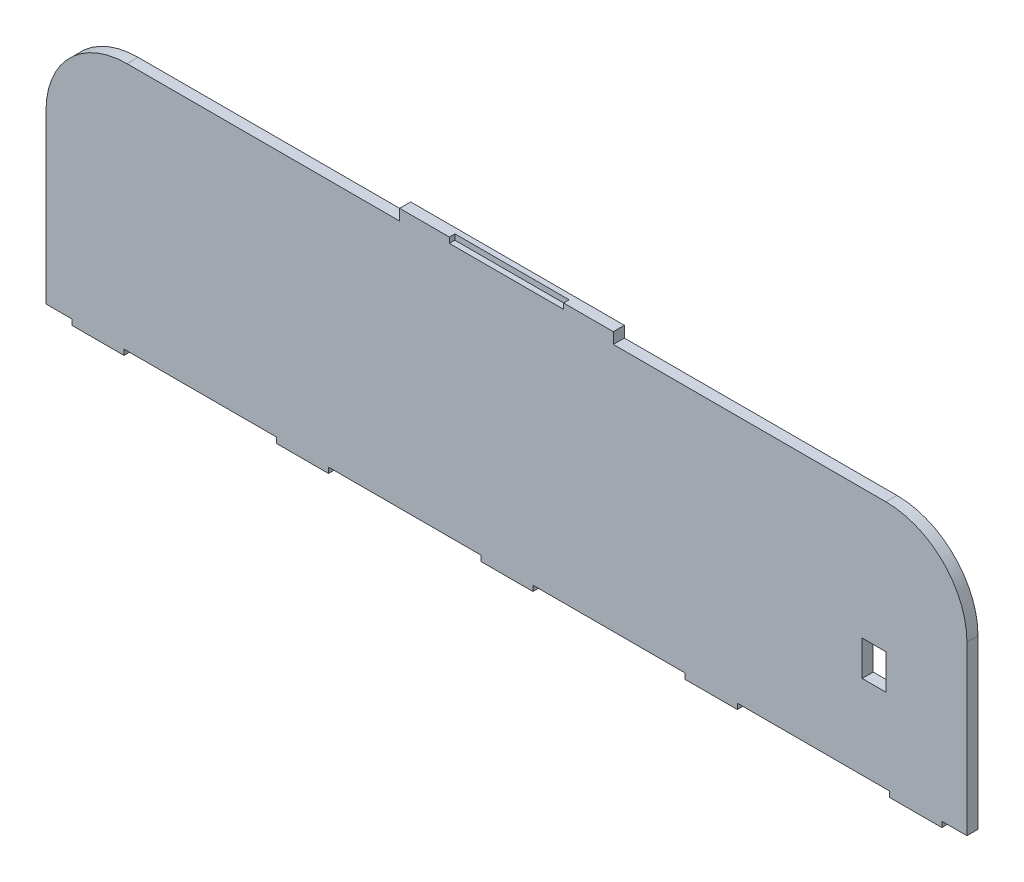
ISO-10303-21;
HEADER;
FILE_DESCRIPTION(('STEP AP214'),'2;1');
FILE_NAME('part.step','',(''),(''),'','','');
FILE_SCHEMA(('AUTOMOTIVE_DESIGN { 1 0 10303 214 1 1 1 1 }'));
ENDSEC;
DATA;
#1=APPLICATION_CONTEXT('core data for automotive mechanical design processes');
#2=APPLICATION_PROTOCOL_DEFINITION('international standard','automotive_design',2000,#1);
#3=PRODUCT_CONTEXT('',#1,'mechanical');
#4=PRODUCT('Part','Part','',(#3));
#5=PRODUCT_RELATED_PRODUCT_CATEGORY('part','',(#4));
#6=PRODUCT_DEFINITION_FORMATION('','',#4);
#7=PRODUCT_DEFINITION_CONTEXT('part definition',#1,'design');
#8=PRODUCT_DEFINITION('design','',#6,#7);
#9=PRODUCT_DEFINITION_SHAPE('','',#8);
#10=(LENGTH_UNIT() NAMED_UNIT(*) SI_UNIT(.MILLI.,.METRE.));
#11=(NAMED_UNIT(*) PLANE_ANGLE_UNIT() SI_UNIT($,.RADIAN.));
#12=(NAMED_UNIT(*) SI_UNIT($,.STERADIAN.) SOLID_ANGLE_UNIT());
#13=UNCERTAINTY_MEASURE_WITH_UNIT(LENGTH_MEASURE(1.E-05),#10,'distance_accuracy_value','');
#14=(GEOMETRIC_REPRESENTATION_CONTEXT(3) GLOBAL_UNCERTAINTY_ASSIGNED_CONTEXT((#13)) GLOBAL_UNIT_ASSIGNED_CONTEXT((#10,
#11,#12)) REPRESENTATION_CONTEXT('',''));
#15=CARTESIAN_POINT('',(0.,0.,0.));
#16=DIRECTION('',(0.,0.,1.));
#17=DIRECTION('',(1.,0.,0.));
#18=AXIS2_PLACEMENT_3D('',#15,#16,#17);
#19=CARTESIAN_POINT('',(-1.11022302462516E-13,501.,6.));
#20=DIRECTION('',(0.,-1.,0.));
#21=DIRECTION('',(0.,0.,-1.));
#22=AXIS2_PLACEMENT_3D('',#19,#20,#21);
#23=PLANE('',#22);
#24=DIRECTION('',(0.,0.,-1.));
#25=VECTOR('',#24,1.);
#26=CARTESIAN_POINT('',(308.,501.,6.));
#27=LINE('',#26,#25);
#28=CARTESIAN_POINT('',(308.,501.,6.));
#29=VERTEX_POINT('',#28);
#30=CARTESIAN_POINT('',(308.,501.,0.));
#31=VERTEX_POINT('',#30);
#32=EDGE_CURVE('E326',#29,#31,#27,.T.);
#33=ORIENTED_EDGE('',*,*,#32,.F.);
#34=DIRECTION('',(-1.,0.,0.));
#35=VECTOR('',#34,1.);
#36=CARTESIAN_POINT('',(-1.11022302462516E-13,501.,6.));
#37=LINE('',#36,#35);
#38=CARTESIAN_POINT('',(456.,501.,6.));
#39=VERTEX_POINT('',#38);
#40=EDGE_CURVE('E508',#39,#29,#37,.T.);
#41=ORIENTED_EDGE('',*,*,#40,.F.);
#42=DIRECTION('',(0.,0.,-1.));
#43=VECTOR('',#42,1.);
#44=CARTESIAN_POINT('',(456.,501.,6.));
#45=LINE('',#44,#43);
#46=CARTESIAN_POINT('',(456.,501.,0.));
#47=VERTEX_POINT('',#46);
#48=EDGE_CURVE('E488',#39,#47,#45,.T.);
#49=ORIENTED_EDGE('',*,*,#48,.T.);
#50=DIRECTION('',(-1.,0.,0.));
#51=VECTOR('',#50,1.);
#52=CARTESIAN_POINT('',(-1.11022302462516E-13,501.,0.));
#53=LINE('',#52,#51);
#54=EDGE_CURVE('E504',#47,#31,#53,.T.);
#55=ORIENTED_EDGE('',*,*,#54,.T.);
#56=EDGE_LOOP('',(#33,#41,#49,#55));
#57=FACE_BOUND('',#56,.T.);
#58=ADVANCED_FACE('F33',(#57),#23,.F.);
#59=CARTESIAN_POINT('',(0.,366.,-0.00999999999999959));
#60=DIRECTION('',(0.,-1.,0.));
#61=DIRECTION('',(0.,0.,-1.));
#62=AXIS2_PLACEMENT_3D('',#59,#60,#61);
#63=PLANE('',#62);
#64=DIRECTION('',(0.,0.,-1.));
#65=VECTOR('',#64,1.);
#66=CARTESIAN_POINT('',(42.35,366.,6.));
#67=LINE('',#66,#65);
#68=CARTESIAN_POINT('',(42.35,366.,6.));
#69=VERTEX_POINT('',#68);
#70=CARTESIAN_POINT('',(42.35,366.,0.));
#71=VERTEX_POINT('',#70);
#72=EDGE_CURVE('E362',#69,#71,#67,.T.);
#73=ORIENTED_EDGE('',*,*,#72,.T.);
#74=DIRECTION('',(1.,0.,0.));
#75=VECTOR('',#74,1.);
#76=CARTESIAN_POINT('',(444.8,366.,0.));
#77=LINE('',#76,#75);
#78=CARTESIAN_POINT('',(125.05,366.,0.));
#79=VERTEX_POINT('',#78);
#80=EDGE_CURVE('E527',#71,#79,#77,.T.);
#81=ORIENTED_EDGE('',*,*,#80,.T.);
#82=DIRECTION('',(0.,0.,-1.));
#83=VECTOR('',#82,1.);
#84=CARTESIAN_POINT('',(125.05,366.,6.));
#85=LINE('',#84,#83);
#86=CARTESIAN_POINT('',(125.05,366.,6.));
#87=VERTEX_POINT('',#86);
#88=EDGE_CURVE('E394',#87,#79,#85,.T.);
#89=ORIENTED_EDGE('',*,*,#88,.F.);
#90=DIRECTION('',(1.,0.,0.));
#91=VECTOR('',#90,1.);
#92=CARTESIAN_POINT('',(0.,366.,6.));
#93=LINE('',#92,#91);
#94=EDGE_CURVE('E523',#69,#87,#93,.T.);
#95=ORIENTED_EDGE('',*,*,#94,.F.);
#96=EDGE_LOOP('',(#73,#81,#89,#95));
#97=FACE_BOUND('',#96,.T.);
#98=ADVANCED_FACE('F588',(#97),#63,.T.);
#99=DIRECTION('',(0.,0.,-1.));
#100=VECTOR('',#99,1.);
#101=CARTESIAN_POINT('',(153.35,366.,6.));
#102=LINE('',#101,#100);
#103=CARTESIAN_POINT('',(153.35,366.,6.));
#104=VERTEX_POINT('',#103);
#105=CARTESIAN_POINT('',(153.35,366.,0.));
#106=VERTEX_POINT('',#105);
#107=EDGE_CURVE('E390',#104,#106,#102,.T.);
#108=ORIENTED_EDGE('',*,*,#107,.T.);
#109=CARTESIAN_POINT('',(236.05,366.,0.));
#110=VERTEX_POINT('',#109);
#111=EDGE_CURVE('E1070',#106,#110,#77,.T.);
#112=ORIENTED_EDGE('',*,*,#111,.T.);
#113=DIRECTION('',(0.,0.,-1.));
#114=VECTOR('',#113,1.);
#115=CARTESIAN_POINT('',(236.05,366.,6.));
#116=LINE('',#115,#114);
#117=CARTESIAN_POINT('',(236.05,366.,6.));
#118=VERTEX_POINT('',#117);
#119=EDGE_CURVE('E422',#118,#110,#116,.T.);
#120=ORIENTED_EDGE('',*,*,#119,.F.);
#121=EDGE_CURVE('E591',#104,#118,#93,.T.);
#122=ORIENTED_EDGE('',*,*,#121,.F.);
#123=EDGE_LOOP('',(#108,#112,#120,#122));
#124=FACE_BOUND('',#123,.T.);
#125=ADVANCED_FACE('F655',(#124),#63,.T.);
#126=DIRECTION('',(0.,0.,-1.));
#127=VECTOR('',#126,1.);
#128=CARTESIAN_POINT('',(264.35,366.,6.));
#129=LINE('',#128,#127);
#130=CARTESIAN_POINT('',(264.35,366.,6.));
#131=VERTEX_POINT('',#130);
#132=CARTESIAN_POINT('',(264.35,366.,0.));
#133=VERTEX_POINT('',#132);
#134=EDGE_CURVE('E418',#131,#133,#129,.T.);
#135=ORIENTED_EDGE('',*,*,#134,.T.);
#136=CARTESIAN_POINT('',(347.05,366.,0.));
#137=VERTEX_POINT('',#136);
#138=EDGE_CURVE('E1072',#133,#137,#77,.T.);
#139=ORIENTED_EDGE('',*,*,#138,.T.);
#140=DIRECTION('',(0.,0.,-1.));
#141=VECTOR('',#140,1.);
#142=CARTESIAN_POINT('',(347.05,366.,6.));
#143=LINE('',#142,#141);
#144=CARTESIAN_POINT('',(347.05,366.,6.));
#145=VERTEX_POINT('',#144);
#146=EDGE_CURVE('E450',#145,#137,#143,.T.);
#147=ORIENTED_EDGE('',*,*,#146,.F.);
#148=EDGE_CURVE('E592',#131,#145,#93,.T.);
#149=ORIENTED_EDGE('',*,*,#148,.F.);
#150=EDGE_LOOP('',(#135,#139,#147,#149));
#151=FACE_BOUND('',#150,.T.);
#152=ADVANCED_FACE('F787',(#151),#63,.T.);
#153=DIRECTION('',(0.,0.,-1.));
#154=VECTOR('',#153,1.);
#155=CARTESIAN_POINT('',(375.35,366.,6.));
#156=LINE('',#155,#154);
#157=CARTESIAN_POINT('',(375.35,366.,6.));
#158=VERTEX_POINT('',#157);
#159=CARTESIAN_POINT('',(375.35,366.,0.));
#160=VERTEX_POINT('',#159);
#161=EDGE_CURVE('E446',#158,#160,#156,.T.);
#162=ORIENTED_EDGE('',*,*,#161,.T.);
#163=CARTESIAN_POINT('',(458.05,366.,0.));
#164=VERTEX_POINT('',#163);
#165=EDGE_CURVE('E1073',#160,#164,#77,.T.);
#166=ORIENTED_EDGE('',*,*,#165,.T.);
#167=DIRECTION('',(0.,0.,-1.));
#168=VECTOR('',#167,1.);
#169=CARTESIAN_POINT('',(458.05,366.,6.));
#170=LINE('',#169,#168);
#171=CARTESIAN_POINT('',(458.05,366.,6.));
#172=VERTEX_POINT('',#171);
#173=EDGE_CURVE('E478',#172,#164,#170,.T.);
#174=ORIENTED_EDGE('',*,*,#173,.F.);
#175=EDGE_CURVE('E596',#158,#172,#93,.T.);
#176=ORIENTED_EDGE('',*,*,#175,.F.);
#177=EDGE_LOOP('',(#162,#166,#174,#176));
#178=FACE_BOUND('',#177,.T.);
#179=ADVANCED_FACE('F744',(#178),#63,.T.);
#180=CARTESIAN_POINT('',(486.35,366.,6.));
#181=VERTEX_POINT('',#180);
#182=CARTESIAN_POINT('',(500.,366.,6.));
#183=VERTEX_POINT('',#182);
#184=EDGE_CURVE('E518',#181,#183,#93,.T.);
#185=ORIENTED_EDGE('',*,*,#184,.F.);
#186=DIRECTION('',(0.,0.,-1.));
#187=VECTOR('',#186,1.);
#188=CARTESIAN_POINT('',(486.35,366.,6.));
#189=LINE('',#188,#187);
#190=CARTESIAN_POINT('',(486.35,366.,0.));
#191=VERTEX_POINT('',#190);
#192=EDGE_CURVE('E474',#181,#191,#189,.T.);
#193=ORIENTED_EDGE('',*,*,#192,.T.);
#194=CARTESIAN_POINT('',(500.,366.,0.));
#195=VERTEX_POINT('',#194);
#196=EDGE_CURVE('E522',#191,#195,#77,.T.);
#197=ORIENTED_EDGE('',*,*,#196,.T.);
#198=DIRECTION('',(0.,0.,-1.));
#199=VECTOR('',#198,1.);
#200=CARTESIAN_POINT('',(500.,366.,6.));
#201=LINE('',#200,#199);
#202=EDGE_CURVE('E515',#183,#195,#201,.T.);
#203=ORIENTED_EDGE('',*,*,#202,.F.);
#204=EDGE_LOOP('',(#185,#193,#197,#203));
#205=FACE_BOUND('',#204,.T.);
#206=ADVANCED_FACE('F608',(#205),#63,.T.);
#207=DIRECTION('',(0.,0.,-1.));
#208=VECTOR('',#207,1.);
#209=CARTESIAN_POINT('',(14.05,366.,6.));
#210=LINE('',#209,#208);
#211=CARTESIAN_POINT('',(14.05,366.,6.));
#212=VERTEX_POINT('',#211);
#213=CARTESIAN_POINT('',(14.05,366.,0.));
#214=VERTEX_POINT('',#213);
#215=EDGE_CURVE('E366',#212,#214,#210,.T.);
#216=ORIENTED_EDGE('',*,*,#215,.F.);
#217=CARTESIAN_POINT('',(-1.04083408558608E-13,366.,6.));
#218=VERTEX_POINT('',#217);
#219=EDGE_CURVE('E519',#218,#212,#93,.T.);
#220=ORIENTED_EDGE('',*,*,#219,.F.);
#221=DIRECTION('',(0.,0.,-1.));
#222=VECTOR('',#221,1.);
#223=CARTESIAN_POINT('',(-1.04083408558608E-13,366.,10.));
#224=LINE('',#223,#222);
#225=CARTESIAN_POINT('',(0.,366.,0.));
#226=VERTEX_POINT('',#225);
#227=EDGE_CURVE('E512',#218,#226,#224,.T.);
#228=ORIENTED_EDGE('',*,*,#227,.T.);
#229=EDGE_CURVE('E524',#226,#214,#77,.T.);
#230=ORIENTED_EDGE('',*,*,#229,.T.);
#231=EDGE_LOOP('',(#216,#220,#228,#230));
#232=FACE_BOUND('',#231,.T.);
#233=ADVANCED_FACE('F572',(#232),#63,.T.);
#234=CARTESIAN_POINT('',(0.,0.,6.));
#235=DIRECTION('',(1.,0.,0.));
#236=DIRECTION('',(0.,1.,0.));
#237=AXIS2_PLACEMENT_3D('',#234,#235,#236);
#238=PLANE('',#237);
#239=DIRECTION('',(0.,-1.,0.));
#240=VECTOR('',#239,1.);
#241=CARTESIAN_POINT('',(0.,0.,0.));
#242=LINE('',#241,#240);
#243=CARTESIAN_POINT('',(-1.01271840769201E-13,457.,0.));
#244=VERTEX_POINT('',#243);
#245=EDGE_CURVE('E37',#244,#226,#242,.T.);
#246=ORIENTED_EDGE('',*,*,#245,.T.);
#247=ORIENTED_EDGE('',*,*,#227,.F.);
#248=DIRECTION('',(0.,-1.,0.));
#249=VECTOR('',#248,1.);
#250=CARTESIAN_POINT('',(0.,0.,6.));
#251=LINE('',#250,#249);
#252=CARTESIAN_POINT('',(-1.01271840769201E-13,457.,6.));
#253=VERTEX_POINT('',#252);
#254=EDGE_CURVE('E557',#253,#218,#251,.T.);
#255=ORIENTED_EDGE('',*,*,#254,.F.);
#256=DIRECTION('',(0.,0.,-1.));
#257=VECTOR('',#256,1.);
#258=CARTESIAN_POINT('',(-1.01271840769201E-13,457.,6.));
#259=LINE('',#258,#257);
#260=EDGE_CURVE('E495',#253,#244,#259,.T.);
#261=ORIENTED_EDGE('',*,*,#260,.T.);
#262=EDGE_LOOP('',(#246,#247,#255,#261));
#263=FACE_BOUND('',#262,.T.);
#264=ADVANCED_FACE('F565',(#263),#238,.F.);
#265=CARTESIAN_POINT('',(43.9999999999999,457.,6.));
#266=DIRECTION('',(0.,0.,-1.));
#267=DIRECTION('',(-1.,0.,0.));
#268=AXIS2_PLACEMENT_3D('',#265,#266,#267);
#269=CYLINDRICAL_SURFACE('',#268,44.);
#270=CARTESIAN_POINT('',(43.9999999999999,457.,6.));
#271=DIRECTION('',(0.,0.,-1.));
#272=DIRECTION('',(-1.,0.,0.));
#273=AXIS2_PLACEMENT_3D('',#270,#271,#272);
#274=CIRCLE('',#273,44.);
#275=CARTESIAN_POINT('',(43.9999999999999,501.,6.));
#276=VERTEX_POINT('',#275);
#277=EDGE_CURVE('E491',#276,#253,#274,.F.);
#278=ORIENTED_EDGE('',*,*,#277,.F.);
#279=DIRECTION('',(0.,0.,-1.));
#280=VECTOR('',#279,1.);
#281=CARTESIAN_POINT('',(43.9999999999999,501.,6.));
#282=LINE('',#281,#280);
#283=CARTESIAN_POINT('',(43.9999999999999,501.,0.));
#284=VERTEX_POINT('',#283);
#285=EDGE_CURVE('E486',#284,#276,#282,.F.);
#286=ORIENTED_EDGE('',*,*,#285,.F.);
#287=CARTESIAN_POINT('',(43.9999999999999,457.,0.));
#288=DIRECTION('',(0.,0.,-1.));
#289=DIRECTION('',(-1.,0.,0.));
#290=AXIS2_PLACEMENT_3D('',#287,#288,#289);
#291=CIRCLE('',#290,44.);
#292=EDGE_CURVE('E498',#244,#284,#291,.T.);
#293=ORIENTED_EDGE('',*,*,#292,.F.);
#294=ORIENTED_EDGE('',*,*,#260,.F.);
#295=EDGE_LOOP('',(#278,#286,#293,#294));
#296=FACE_BOUND('',#295,.T.);
#297=ADVANCED_FACE('F639',(#296),#269,.T.);
#298=CARTESIAN_POINT('',(192.,501.,6.));
#299=VERTEX_POINT('',#298);
#300=EDGE_CURVE('E58',#299,#276,#37,.T.);
#301=ORIENTED_EDGE('',*,*,#300,.F.);
#302=DIRECTION('',(0.,0.,-1.));
#303=VECTOR('',#302,1.);
#304=CARTESIAN_POINT('',(192.,501.,6.));
#305=LINE('',#304,#303);
#306=CARTESIAN_POINT('',(192.,501.,0.));
#307=VERTEX_POINT('',#306);
#308=EDGE_CURVE('E336',#299,#307,#305,.T.);
#309=ORIENTED_EDGE('',*,*,#308,.T.);
#310=EDGE_CURVE('E507',#307,#284,#53,.T.);
#311=ORIENTED_EDGE('',*,*,#310,.T.);
#312=ORIENTED_EDGE('',*,*,#285,.T.);
#313=EDGE_LOOP('',(#301,#309,#311,#312));
#314=FACE_BOUND('',#313,.T.);
#315=ADVANCED_FACE('F636',(#314),#23,.F.);
#316=CARTESIAN_POINT('',(456.,457.,6.));
#317=DIRECTION('',(0.,0.,-1.));
#318=DIRECTION('',(-1.,0.,0.));
#319=AXIS2_PLACEMENT_3D('',#316,#317,#318);
#320=CYLINDRICAL_SURFACE('',#319,44.);
#321=CARTESIAN_POINT('',(456.,457.,6.));
#322=DIRECTION('',(0.,0.,-1.));
#323=DIRECTION('',(-1.,0.,0.));
#324=AXIS2_PLACEMENT_3D('',#321,#322,#323);
#325=CIRCLE('',#324,44.);
#326=CARTESIAN_POINT('',(500.,457.,6.));
#327=VERTEX_POINT('',#326);
#328=EDGE_CURVE('E493',#327,#39,#325,.F.);
#329=ORIENTED_EDGE('',*,*,#328,.F.);
#330=DIRECTION('',(0.,0.,-1.));
#331=VECTOR('',#330,1.);
#332=CARTESIAN_POINT('',(500.,457.,6.));
#333=LINE('',#332,#331);
#334=CARTESIAN_POINT('',(500.,457.,0.));
#335=VERTEX_POINT('',#334);
#336=EDGE_CURVE('E477',#335,#327,#333,.F.);
#337=ORIENTED_EDGE('',*,*,#336,.F.);
#338=CARTESIAN_POINT('',(456.,457.,0.));
#339=DIRECTION('',(0.,0.,-1.));
#340=DIRECTION('',(-1.,0.,0.));
#341=AXIS2_PLACEMENT_3D('',#338,#339,#340);
#342=CIRCLE('',#341,44.);
#343=EDGE_CURVE('E501',#47,#335,#342,.T.);
#344=ORIENTED_EDGE('',*,*,#343,.F.);
#345=ORIENTED_EDGE('',*,*,#48,.F.);
#346=EDGE_LOOP('',(#329,#337,#344,#345));
#347=FACE_BOUND('',#346,.T.);
#348=ADVANCED_FACE('F615',(#347),#320,.T.);
#349=CARTESIAN_POINT('',(500.,0.,6.));
#350=DIRECTION('',(-1.,0.,0.));
#351=DIRECTION('',(0.,-1.,0.));
#352=AXIS2_PLACEMENT_3D('',#349,#350,#351);
#353=PLANE('',#352);
#354=DIRECTION('',(0.,1.,0.));
#355=VECTOR('',#354,1.);
#356=CARTESIAN_POINT('',(500.,0.,6.));
#357=LINE('',#356,#355);
#358=EDGE_CURVE('E511',#183,#327,#357,.T.);
#359=ORIENTED_EDGE('',*,*,#358,.F.);
#360=ORIENTED_EDGE('',*,*,#202,.T.);
#361=DIRECTION('',(0.,1.,0.));
#362=VECTOR('',#361,1.);
#363=CARTESIAN_POINT('',(500.,0.,0.));
#364=LINE('',#363,#362);
#365=EDGE_CURVE('E506',#195,#335,#364,.T.);
#366=ORIENTED_EDGE('',*,*,#365,.T.);
#367=ORIENTED_EDGE('',*,*,#336,.T.);
#368=EDGE_LOOP('',(#359,#360,#366,#367));
#369=FACE_BOUND('',#368,.T.);
#370=ADVANCED_FACE('F610',(#369),#353,.F.);
#371=CARTESIAN_POINT('',(443.1,430.5,10.));
#372=DIRECTION('',(-1.,0.,0.));
#373=DIRECTION('',(0.,-1.,0.));
#374=AXIS2_PLACEMENT_3D('',#371,#372,#373);
#375=PLANE('',#374);
#376=DIRECTION('',(0.,0.,-1.));
#377=VECTOR('',#376,1.);
#378=CARTESIAN_POINT('',(443.1,411.5,10.));
#379=LINE('',#378,#377);
#380=CARTESIAN_POINT('',(443.1,411.5,6.));
#381=VERTEX_POINT('',#380);
#382=CARTESIAN_POINT('',(443.1,411.5,0.));
#383=VERTEX_POINT('',#382);
#384=EDGE_CURVE('E544',#381,#383,#379,.T.);
#385=ORIENTED_EDGE('',*,*,#384,.T.);
#386=DIRECTION('',(0.,1.,0.));
#387=VECTOR('',#386,1.);
#388=CARTESIAN_POINT('',(443.1,430.5,0.));
#389=LINE('',#388,#387);
#390=CARTESIAN_POINT('',(443.1,430.5,0.));
#391=VERTEX_POINT('',#390);
#392=EDGE_CURVE('E551',#383,#391,#389,.T.);
#393=ORIENTED_EDGE('',*,*,#392,.T.);
#394=DIRECTION('',(0.,0.,-1.));
#395=VECTOR('',#394,1.);
#396=CARTESIAN_POINT('',(443.1,430.5,10.));
#397=LINE('',#396,#395);
#398=CARTESIAN_POINT('',(443.1,430.5,6.));
#399=VERTEX_POINT('',#398);
#400=EDGE_CURVE('E546',#399,#391,#397,.T.);
#401=ORIENTED_EDGE('',*,*,#400,.F.);
#402=DIRECTION('',(0.,1.,0.));
#403=VECTOR('',#402,1.);
#404=CARTESIAN_POINT('',(443.100000000001,1.2945784795037E-12,6.));
#405=LINE('',#404,#403);
#406=EDGE_CURVE('E533',#381,#399,#405,.T.);
#407=ORIENTED_EDGE('',*,*,#406,.F.);
#408=EDGE_LOOP('',(#385,#393,#401,#407));
#409=FACE_BOUND('',#408,.T.);
#410=ADVANCED_FACE('F666',(#409),#375,.F.);
#411=CARTESIAN_POINT('',(456.,411.5,10.));
#412=DIRECTION('',(0.,-1.,0.));
#413=DIRECTION('',(1.,0.,0.));
#414=AXIS2_PLACEMENT_3D('',#411,#412,#413);
#415=PLANE('',#414);
#416=DIRECTION('',(0.,0.,-1.));
#417=VECTOR('',#416,1.);
#418=CARTESIAN_POINT('',(456.,411.5,10.));
#419=LINE('',#418,#417);
#420=CARTESIAN_POINT('',(456.,411.5,6.));
#421=VERTEX_POINT('',#420);
#422=CARTESIAN_POINT('',(456.,411.5,0.));
#423=VERTEX_POINT('',#422);
#424=EDGE_CURVE('E540',#421,#423,#419,.T.);
#425=ORIENTED_EDGE('',*,*,#424,.T.);
#426=DIRECTION('',(-1.,0.,0.));
#427=VECTOR('',#426,1.);
#428=CARTESIAN_POINT('',(456.,411.5,0.));
#429=LINE('',#428,#427);
#430=EDGE_CURVE('E42',#423,#383,#429,.T.);
#431=ORIENTED_EDGE('',*,*,#430,.T.);
#432=ORIENTED_EDGE('',*,*,#384,.F.);
#433=DIRECTION('',(-1.,0.,0.));
#434=VECTOR('',#433,1.);
#435=CARTESIAN_POINT('',(-1.77076269237694E-12,411.499999999998,6.));
#436=LINE('',#435,#434);
#437=EDGE_CURVE('E536',#421,#381,#436,.T.);
#438=ORIENTED_EDGE('',*,*,#437,.F.);
#439=EDGE_LOOP('',(#425,#431,#432,#438));
#440=FACE_BOUND('',#439,.T.);
#441=ADVANCED_FACE('F662',(#440),#415,.F.);
#442=CARTESIAN_POINT('',(456.,430.5,10.));
#443=DIRECTION('',(1.,0.,0.));
#444=DIRECTION('',(0.,0.,-1.));
#445=AXIS2_PLACEMENT_3D('',#442,#443,#444);
#446=PLANE('',#445);
#447=DIRECTION('',(0.,0.,-1.));
#448=VECTOR('',#447,1.);
#449=CARTESIAN_POINT('',(456.,430.5,10.));
#450=LINE('',#449,#448);
#451=CARTESIAN_POINT('',(456.,430.5,6.));
#452=VERTEX_POINT('',#451);
#453=CARTESIAN_POINT('',(456.,430.5,0.));
#454=VERTEX_POINT('',#453);
#455=EDGE_CURVE('E539',#452,#454,#450,.T.);
#456=ORIENTED_EDGE('',*,*,#455,.T.);
#457=DIRECTION('',(0.,-1.,0.));
#458=VECTOR('',#457,1.);
#459=CARTESIAN_POINT('',(456.,430.5,0.));
#460=LINE('',#459,#458);
#461=EDGE_CURVE('E11',#454,#423,#460,.T.);
#462=ORIENTED_EDGE('',*,*,#461,.T.);
#463=ORIENTED_EDGE('',*,*,#424,.F.);
#464=DIRECTION('',(0.,-1.,0.));
#465=VECTOR('',#464,1.);
#466=CARTESIAN_POINT('',(456.,0.,6.));
#467=LINE('',#466,#465);
#468=EDGE_CURVE('E526',#452,#421,#467,.T.);
#469=ORIENTED_EDGE('',*,*,#468,.F.);
#470=EDGE_LOOP('',(#456,#462,#463,#469));
#471=FACE_BOUND('',#470,.T.);
#472=ADVANCED_FACE('F658',(#471),#446,.F.);
#473=CARTESIAN_POINT('',(456.,430.5,10.));
#474=DIRECTION('',(0.,1.,0.));
#475=DIRECTION('',(-1.,0.,0.));
#476=AXIS2_PLACEMENT_3D('',#473,#474,#475);
#477=PLANE('',#476);
#478=ORIENTED_EDGE('',*,*,#400,.T.);
#479=DIRECTION('',(1.,0.,0.));
#480=VECTOR('',#479,1.);
#481=CARTESIAN_POINT('',(456.,430.5,0.));
#482=LINE('',#481,#480);
#483=EDGE_CURVE('E543',#391,#454,#482,.T.);
#484=ORIENTED_EDGE('',*,*,#483,.T.);
#485=ORIENTED_EDGE('',*,*,#455,.F.);
#486=DIRECTION('',(1.,0.,0.));
#487=VECTOR('',#486,1.);
#488=CARTESIAN_POINT('',(1.85252330271756E-12,430.500000000002,6.));
#489=LINE('',#488,#487);
#490=EDGE_CURVE('E530',#399,#452,#489,.T.);
#491=ORIENTED_EDGE('',*,*,#490,.F.);
#492=EDGE_LOOP('',(#478,#484,#485,#491));
#493=FACE_BOUND('',#492,.T.);
#494=ADVANCED_FACE('F661',(#493),#477,.F.);
#495=CARTESIAN_POINT('',(0.,0.,6.));
#496=DIRECTION('',(0.,0.,-1.));
#497=DIRECTION('',(-1.,0.,0.));
#498=AXIS2_PLACEMENT_3D('',#495,#496,#497);
#499=PLANE('',#498);
#500=ORIENTED_EDGE('',*,*,#490,.T.);
#501=ORIENTED_EDGE('',*,*,#468,.T.);
#502=ORIENTED_EDGE('',*,*,#437,.T.);
#503=ORIENTED_EDGE('',*,*,#406,.T.);
#504=EDGE_LOOP('',(#500,#501,#502,#503));
#505=FACE_BOUND('',#504,.T.);
#506=DIRECTION('',(-1.,0.,0.));
#507=VECTOR('',#506,1.);
#508=CARTESIAN_POINT('',(308.,507.,6.));
#509=LINE('',#508,#507);
#510=CARTESIAN_POINT('',(308.,507.,6.));
#511=VERTEX_POINT('',#510);
#512=CARTESIAN_POINT('',(281.,507.,6.));
#513=VERTEX_POINT('',#512);
#514=EDGE_CURVE('E320',#511,#513,#509,.T.);
#515=ORIENTED_EDGE('',*,*,#514,.T.);
#516=DIRECTION('',(0.,1.,0.));
#517=VECTOR('',#516,1.);
#518=CARTESIAN_POINT('',(281.,504.,6.));
#519=LINE('',#518,#517);
#520=CARTESIAN_POINT('',(281.,504.,6.));
#521=VERTEX_POINT('',#520);
#522=EDGE_CURVE('E312',#521,#513,#519,.T.);
#523=ORIENTED_EDGE('',*,*,#522,.F.);
#524=DIRECTION('',(1.,0.,0.));
#525=VECTOR('',#524,1.);
#526=CARTESIAN_POINT('',(0.,504.,6.));
#527=LINE('',#526,#525);
#528=CARTESIAN_POINT('',(219.,504.,6.));
#529=VERTEX_POINT('',#528);
#530=EDGE_CURVE('E289',#529,#521,#527,.T.);
#531=ORIENTED_EDGE('',*,*,#530,.F.);
#532=DIRECTION('',(0.,1.,0.));
#533=VECTOR('',#532,1.);
#534=CARTESIAN_POINT('',(219.,504.,6.));
#535=LINE('',#534,#533);
#536=CARTESIAN_POINT('',(219.,507.,6.));
#537=VERTEX_POINT('',#536);
#538=EDGE_CURVE('E285',#529,#537,#535,.T.);
#539=ORIENTED_EDGE('',*,*,#538,.T.);
#540=CARTESIAN_POINT('',(192.,507.,6.));
#541=VERTEX_POINT('',#540);
#542=EDGE_CURVE('E318',#537,#541,#509,.T.);
#543=ORIENTED_EDGE('',*,*,#542,.T.);
#544=DIRECTION('',(0.,1.,0.));
#545=VECTOR('',#544,1.);
#546=CARTESIAN_POINT('',(192.,501.,6.));
#547=LINE('',#546,#545);
#548=EDGE_CURVE('E323',#299,#541,#547,.T.);
#549=ORIENTED_EDGE('',*,*,#548,.F.);
#550=ORIENTED_EDGE('',*,*,#300,.T.);
#551=ORIENTED_EDGE('',*,*,#277,.T.);
#552=ORIENTED_EDGE('',*,*,#254,.T.);
#553=ORIENTED_EDGE('',*,*,#219,.T.);
#554=DIRECTION('',(0.,1.,0.));
#555=VECTOR('',#554,1.);
#556=CARTESIAN_POINT('',(14.05,366.,6.));
#557=LINE('',#556,#555);
#558=CARTESIAN_POINT('',(14.05,363.,6.));
#559=VERTEX_POINT('',#558);
#560=EDGE_CURVE('E351',#559,#212,#557,.T.);
#561=ORIENTED_EDGE('',*,*,#560,.F.);
#562=DIRECTION('',(-1.,0.,0.));
#563=VECTOR('',#562,1.);
#564=CARTESIAN_POINT('',(42.35,363.,6.));
#565=LINE('',#564,#563);
#566=CARTESIAN_POINT('',(42.35,363.,6.));
#567=VERTEX_POINT('',#566);
#568=EDGE_CURVE('E347',#567,#559,#565,.T.);
#569=ORIENTED_EDGE('',*,*,#568,.F.);
#570=DIRECTION('',(0.,-1.,0.));
#571=VECTOR('',#570,1.);
#572=CARTESIAN_POINT('',(42.35,366.,6.));
#573=LINE('',#572,#571);
#574=EDGE_CURVE('E344',#69,#567,#573,.T.);
#575=ORIENTED_EDGE('',*,*,#574,.F.);
#576=ORIENTED_EDGE('',*,*,#94,.T.);
#577=DIRECTION('',(0.,1.,0.));
#578=VECTOR('',#577,1.);
#579=CARTESIAN_POINT('',(125.05,366.,6.));
#580=LINE('',#579,#578);
#581=CARTESIAN_POINT('',(125.05,363.,6.));
#582=VERTEX_POINT('',#581);
#583=EDGE_CURVE('E379',#582,#87,#580,.T.);
#584=ORIENTED_EDGE('',*,*,#583,.F.);
#585=DIRECTION('',(-1.,0.,0.));
#586=VECTOR('',#585,1.);
#587=CARTESIAN_POINT('',(153.35,363.,6.));
#588=LINE('',#587,#586);
#589=CARTESIAN_POINT('',(153.35,363.,6.));
#590=VERTEX_POINT('',#589);
#591=EDGE_CURVE('E375',#590,#582,#588,.T.);
#592=ORIENTED_EDGE('',*,*,#591,.F.);
#593=DIRECTION('',(0.,-1.,0.));
#594=VECTOR('',#593,1.);
#595=CARTESIAN_POINT('',(153.35,366.,6.));
#596=LINE('',#595,#594);
#597=EDGE_CURVE('E372',#104,#590,#596,.T.);
#598=ORIENTED_EDGE('',*,*,#597,.F.);
#599=ORIENTED_EDGE('',*,*,#121,.T.);
#600=DIRECTION('',(0.,1.,0.));
#601=VECTOR('',#600,1.);
#602=CARTESIAN_POINT('',(236.05,366.,6.));
#603=LINE('',#602,#601);
#604=CARTESIAN_POINT('',(236.05,363.,6.));
#605=VERTEX_POINT('',#604);
#606=EDGE_CURVE('E407',#605,#118,#603,.T.);
#607=ORIENTED_EDGE('',*,*,#606,.F.);
#608=DIRECTION('',(-1.,0.,0.));
#609=VECTOR('',#608,1.);
#610=CARTESIAN_POINT('',(264.35,363.,6.));
#611=LINE('',#610,#609);
#612=CARTESIAN_POINT('',(264.35,363.,6.));
#613=VERTEX_POINT('',#612);
#614=EDGE_CURVE('E403',#613,#605,#611,.T.);
#615=ORIENTED_EDGE('',*,*,#614,.F.);
#616=DIRECTION('',(0.,-1.,0.));
#617=VECTOR('',#616,1.);
#618=CARTESIAN_POINT('',(264.35,366.,6.));
#619=LINE('',#618,#617);
#620=EDGE_CURVE('E400',#131,#613,#619,.T.);
#621=ORIENTED_EDGE('',*,*,#620,.F.);
#622=ORIENTED_EDGE('',*,*,#148,.T.);
#623=DIRECTION('',(0.,1.,0.));
#624=VECTOR('',#623,1.);
#625=CARTESIAN_POINT('',(347.05,366.,6.));
#626=LINE('',#625,#624);
#627=CARTESIAN_POINT('',(347.05,363.,6.));
#628=VERTEX_POINT('',#627);
#629=EDGE_CURVE('E435',#628,#145,#626,.T.);
#630=ORIENTED_EDGE('',*,*,#629,.F.);
#631=DIRECTION('',(-1.,0.,0.));
#632=VECTOR('',#631,1.);
#633=CARTESIAN_POINT('',(375.35,363.,6.));
#634=LINE('',#633,#632);
#635=CARTESIAN_POINT('',(375.35,363.,6.));
#636=VERTEX_POINT('',#635);
#637=EDGE_CURVE('E431',#636,#628,#634,.T.);
#638=ORIENTED_EDGE('',*,*,#637,.F.);
#639=DIRECTION('',(0.,-1.,0.));
#640=VECTOR('',#639,1.);
#641=CARTESIAN_POINT('',(375.35,366.,6.));
#642=LINE('',#641,#640);
#643=EDGE_CURVE('E428',#158,#636,#642,.T.);
#644=ORIENTED_EDGE('',*,*,#643,.F.);
#645=ORIENTED_EDGE('',*,*,#175,.T.);
#646=DIRECTION('',(0.,1.,0.));
#647=VECTOR('',#646,1.);
#648=CARTESIAN_POINT('',(458.05,366.,6.));
#649=LINE('',#648,#647);
#650=CARTESIAN_POINT('',(458.05,363.,6.));
#651=VERTEX_POINT('',#650);
#652=EDGE_CURVE('E463',#651,#172,#649,.T.);
#653=ORIENTED_EDGE('',*,*,#652,.F.);
#654=DIRECTION('',(-1.,0.,0.));
#655=VECTOR('',#654,1.);
#656=CARTESIAN_POINT('',(486.35,363.,6.));
#657=LINE('',#656,#655);
#658=CARTESIAN_POINT('',(486.35,363.,6.));
#659=VERTEX_POINT('',#658);
#660=EDGE_CURVE('E459',#659,#651,#657,.T.);
#661=ORIENTED_EDGE('',*,*,#660,.F.);
#662=DIRECTION('',(0.,-1.,0.));
#663=VECTOR('',#662,1.);
#664=CARTESIAN_POINT('',(486.35,366.,6.));
#665=LINE('',#664,#663);
#666=EDGE_CURVE('E456',#181,#659,#665,.T.);
#667=ORIENTED_EDGE('',*,*,#666,.F.);
#668=ORIENTED_EDGE('',*,*,#184,.T.);
#669=ORIENTED_EDGE('',*,*,#358,.T.);
#670=ORIENTED_EDGE('',*,*,#328,.T.);
#671=ORIENTED_EDGE('',*,*,#40,.T.);
#672=DIRECTION('',(0.,1.,0.));
#673=VECTOR('',#672,1.);
#674=CARTESIAN_POINT('',(308.,501.,6.));
#675=LINE('',#674,#673);
#676=EDGE_CURVE('E315',#29,#511,#675,.T.);
#677=ORIENTED_EDGE('',*,*,#676,.T.);
#678=EDGE_LOOP('',(#515,#523,#531,#539,#543,#549,#550,#551,#552,#553,#561,#569,#575,#576,#584,
#592,#598,#599,#607,#615,#621,#622,#630,#638,#644,#645,#653,#661,#667,#668,#669,#670,#671,#677));
#679=FACE_BOUND('',#678,.T.);
#680=ADVANCED_FACE('F575',(#505,#679),#499,.F.);
#681=CARTESIAN_POINT('',(0.,0.,0.));
#682=DIRECTION('',(0.,0.,-1.));
#683=DIRECTION('',(-1.,0.,0.));
#684=AXIS2_PLACEMENT_3D('',#681,#682,#683);
#685=PLANE('',#684);
#686=ORIENTED_EDGE('',*,*,#461,.F.);
#687=ORIENTED_EDGE('',*,*,#483,.F.);
#688=ORIENTED_EDGE('',*,*,#392,.F.);
#689=ORIENTED_EDGE('',*,*,#430,.F.);
#690=EDGE_LOOP('',(#686,#687,#688,#689));
#691=FACE_BOUND('',#690,.T.);
#692=ORIENTED_EDGE('',*,*,#229,.F.);
#693=ORIENTED_EDGE('',*,*,#245,.F.);
#694=ORIENTED_EDGE('',*,*,#292,.T.);
#695=ORIENTED_EDGE('',*,*,#310,.F.);
#696=DIRECTION('',(0.,1.,0.));
#697=VECTOR('',#696,1.);
#698=CARTESIAN_POINT('',(192.,501.,0.));
#699=LINE('',#698,#697);
#700=CARTESIAN_POINT('',(192.,507.,0.));
#701=VERTEX_POINT('',#700);
#702=EDGE_CURVE('E319',#307,#701,#699,.T.);
#703=ORIENTED_EDGE('',*,*,#702,.T.);
#704=DIRECTION('',(-1.,0.,0.));
#705=VECTOR('',#704,1.);
#706=CARTESIAN_POINT('',(308.,507.,0.));
#707=LINE('',#706,#705);
#708=CARTESIAN_POINT('',(308.,507.,0.));
#709=VERTEX_POINT('',#708);
#710=EDGE_CURVE('E329',#709,#701,#707,.T.);
#711=ORIENTED_EDGE('',*,*,#710,.F.);
#712=DIRECTION('',(0.,1.,0.));
#713=VECTOR('',#712,1.);
#714=CARTESIAN_POINT('',(308.,501.,0.));
#715=LINE('',#714,#713);
#716=EDGE_CURVE('E311',#31,#709,#715,.T.);
#717=ORIENTED_EDGE('',*,*,#716,.F.);
#718=ORIENTED_EDGE('',*,*,#54,.F.);
#719=ORIENTED_EDGE('',*,*,#343,.T.);
#720=ORIENTED_EDGE('',*,*,#365,.F.);
#721=ORIENTED_EDGE('',*,*,#196,.F.);
#722=DIRECTION('',(0.,-1.,0.));
#723=VECTOR('',#722,1.);
#724=CARTESIAN_POINT('',(486.35,366.,0.));
#725=LINE('',#724,#723);
#726=CARTESIAN_POINT('',(486.35,363.,0.));
#727=VERTEX_POINT('',#726);
#728=EDGE_CURVE('E449',#191,#727,#725,.T.);
#729=ORIENTED_EDGE('',*,*,#728,.T.);
#730=DIRECTION('',(-1.,0.,0.));
#731=VECTOR('',#730,1.);
#732=CARTESIAN_POINT('',(486.35,363.,0.));
#733=LINE('',#732,#731);
#734=CARTESIAN_POINT('',(458.05,363.,0.));
#735=VERTEX_POINT('',#734);
#736=EDGE_CURVE('E469',#727,#735,#733,.T.);
#737=ORIENTED_EDGE('',*,*,#736,.T.);
#738=DIRECTION('',(0.,1.,0.));
#739=VECTOR('',#738,1.);
#740=CARTESIAN_POINT('',(458.05,366.,0.));
#741=LINE('',#740,#739);
#742=EDGE_CURVE('E460',#735,#164,#741,.T.);
#743=ORIENTED_EDGE('',*,*,#742,.T.);
#744=ORIENTED_EDGE('',*,*,#165,.F.);
#745=DIRECTION('',(0.,-1.,0.));
#746=VECTOR('',#745,1.);
#747=CARTESIAN_POINT('',(375.35,366.,0.));
#748=LINE('',#747,#746);
#749=CARTESIAN_POINT('',(375.35,363.,0.));
#750=VERTEX_POINT('',#749);
#751=EDGE_CURVE('E421',#160,#750,#748,.T.);
#752=ORIENTED_EDGE('',*,*,#751,.T.);
#753=DIRECTION('',(-1.,0.,0.));
#754=VECTOR('',#753,1.);
#755=CARTESIAN_POINT('',(375.35,363.,0.));
#756=LINE('',#755,#754);
#757=CARTESIAN_POINT('',(347.05,363.,0.));
#758=VERTEX_POINT('',#757);
#759=EDGE_CURVE('E441',#750,#758,#756,.T.);
#760=ORIENTED_EDGE('',*,*,#759,.T.);
#761=DIRECTION('',(0.,1.,0.));
#762=VECTOR('',#761,1.);
#763=CARTESIAN_POINT('',(347.05,366.,0.));
#764=LINE('',#763,#762);
#765=EDGE_CURVE('E432',#758,#137,#764,.T.);
#766=ORIENTED_EDGE('',*,*,#765,.T.);
#767=ORIENTED_EDGE('',*,*,#138,.F.);
#768=DIRECTION('',(0.,-1.,0.));
#769=VECTOR('',#768,1.);
#770=CARTESIAN_POINT('',(264.35,366.,0.));
#771=LINE('',#770,#769);
#772=CARTESIAN_POINT('',(264.35,363.,0.));
#773=VERTEX_POINT('',#772);
#774=EDGE_CURVE('E393',#133,#773,#771,.T.);
#775=ORIENTED_EDGE('',*,*,#774,.T.);
#776=DIRECTION('',(-1.,0.,0.));
#777=VECTOR('',#776,1.);
#778=CARTESIAN_POINT('',(264.35,363.,0.));
#779=LINE('',#778,#777);
#780=CARTESIAN_POINT('',(236.05,363.,0.));
#781=VERTEX_POINT('',#780);
#782=EDGE_CURVE('E413',#773,#781,#779,.T.);
#783=ORIENTED_EDGE('',*,*,#782,.T.);
#784=DIRECTION('',(0.,1.,0.));
#785=VECTOR('',#784,1.);
#786=CARTESIAN_POINT('',(236.05,366.,0.));
#787=LINE('',#786,#785);
#788=EDGE_CURVE('E404',#781,#110,#787,.T.);
#789=ORIENTED_EDGE('',*,*,#788,.T.);
#790=ORIENTED_EDGE('',*,*,#111,.F.);
#791=DIRECTION('',(0.,-1.,0.));
#792=VECTOR('',#791,1.);
#793=CARTESIAN_POINT('',(153.35,366.,0.));
#794=LINE('',#793,#792);
#795=CARTESIAN_POINT('',(153.35,363.,0.));
#796=VERTEX_POINT('',#795);
#797=EDGE_CURVE('E365',#106,#796,#794,.T.);
#798=ORIENTED_EDGE('',*,*,#797,.T.);
#799=DIRECTION('',(-1.,0.,0.));
#800=VECTOR('',#799,1.);
#801=CARTESIAN_POINT('',(153.35,363.,0.));
#802=LINE('',#801,#800);
#803=CARTESIAN_POINT('',(125.05,363.,0.));
#804=VERTEX_POINT('',#803);
#805=EDGE_CURVE('E385',#796,#804,#802,.T.);
#806=ORIENTED_EDGE('',*,*,#805,.T.);
#807=DIRECTION('',(0.,1.,0.));
#808=VECTOR('',#807,1.);
#809=CARTESIAN_POINT('',(125.05,366.,0.));
#810=LINE('',#809,#808);
#811=EDGE_CURVE('E376',#804,#79,#810,.T.);
#812=ORIENTED_EDGE('',*,*,#811,.T.);
#813=ORIENTED_EDGE('',*,*,#80,.F.);
#814=DIRECTION('',(0.,-1.,0.));
#815=VECTOR('',#814,1.);
#816=CARTESIAN_POINT('',(42.35,366.,0.));
#817=LINE('',#816,#815);
#818=CARTESIAN_POINT('',(42.35,363.,0.));
#819=VERTEX_POINT('',#818);
#820=EDGE_CURVE('E343',#71,#819,#817,.T.);
#821=ORIENTED_EDGE('',*,*,#820,.T.);
#822=DIRECTION('',(-1.,0.,0.));
#823=VECTOR('',#822,1.);
#824=CARTESIAN_POINT('',(42.35,363.,0.));
#825=LINE('',#824,#823);
#826=CARTESIAN_POINT('',(14.05,363.,0.));
#827=VERTEX_POINT('',#826);
#828=EDGE_CURVE('E357',#819,#827,#825,.T.);
#829=ORIENTED_EDGE('',*,*,#828,.T.);
#830=DIRECTION('',(0.,1.,0.));
#831=VECTOR('',#830,1.);
#832=CARTESIAN_POINT('',(14.05,366.,0.));
#833=LINE('',#832,#831);
#834=EDGE_CURVE('E348',#827,#214,#833,.T.);
#835=ORIENTED_EDGE('',*,*,#834,.T.);
#836=EDGE_LOOP('',(#692,#693,#694,#695,#703,#711,#717,#718,#719,#720,#721,#729,#737,#743,#744,
#752,#760,#766,#767,#775,#783,#789,#790,#798,#806,#812,#813,#821,#829,#835));
#837=FACE_BOUND('',#836,.T.);
#838=ADVANCED_FACE('F35',(#691,#837),#685,.T.);
#839=CARTESIAN_POINT('',(486.35,366.,6.));
#840=DIRECTION('',(1.,0.,0.));
#841=DIRECTION('',(0.,0.,-1.));
#842=AXIS2_PLACEMENT_3D('',#839,#840,#841);
#843=PLANE('',#842);
#844=ORIENTED_EDGE('',*,*,#728,.F.);
#845=ORIENTED_EDGE('',*,*,#192,.F.);
#846=ORIENTED_EDGE('',*,*,#666,.T.);
#847=DIRECTION('',(0.,0.,-1.));
#848=VECTOR('',#847,1.);
#849=CARTESIAN_POINT('',(486.35,363.,6.));
#850=LINE('',#849,#848);
#851=EDGE_CURVE('E466',#659,#727,#850,.T.);
#852=ORIENTED_EDGE('',*,*,#851,.T.);
#853=EDGE_LOOP('',(#844,#845,#846,#852));
#854=FACE_BOUND('',#853,.T.);
#855=ADVANCED_FACE('F674',(#854),#843,.T.);
#856=CARTESIAN_POINT('',(458.05,366.,6.));
#857=DIRECTION('',(-1.,0.,0.));
#858=DIRECTION('',(0.,0.,1.));
#859=AXIS2_PLACEMENT_3D('',#856,#857,#858);
#860=PLANE('',#859);
#861=ORIENTED_EDGE('',*,*,#742,.F.);
#862=DIRECTION('',(0.,0.,-1.));
#863=VECTOR('',#862,1.);
#864=CARTESIAN_POINT('',(458.05,363.,6.));
#865=LINE('',#864,#863);
#866=EDGE_CURVE('E481',#651,#735,#865,.T.);
#867=ORIENTED_EDGE('',*,*,#866,.F.);
#868=ORIENTED_EDGE('',*,*,#652,.T.);
#869=ORIENTED_EDGE('',*,*,#173,.T.);
#870=EDGE_LOOP('',(#861,#867,#868,#869));
#871=FACE_BOUND('',#870,.T.);
#872=ADVANCED_FACE('F694',(#871),#860,.T.);
#873=CARTESIAN_POINT('',(486.35,363.,6.));
#874=DIRECTION('',(0.,-1.,0.));
#875=DIRECTION('',(0.,0.,-1.));
#876=AXIS2_PLACEMENT_3D('',#873,#874,#875);
#877=PLANE('',#876);
#878=ORIENTED_EDGE('',*,*,#736,.F.);
#879=ORIENTED_EDGE('',*,*,#851,.F.);
#880=ORIENTED_EDGE('',*,*,#660,.T.);
#881=ORIENTED_EDGE('',*,*,#866,.T.);
#882=EDGE_LOOP('',(#878,#879,#880,#881));
#883=FACE_BOUND('',#882,.T.);
#884=ADVANCED_FACE('F700',(#883),#877,.T.);
#885=CARTESIAN_POINT('',(375.35,366.,6.));
#886=DIRECTION('',(1.,0.,0.));
#887=DIRECTION('',(0.,0.,-1.));
#888=AXIS2_PLACEMENT_3D('',#885,#886,#887);
#889=PLANE('',#888);
#890=ORIENTED_EDGE('',*,*,#751,.F.);
#891=ORIENTED_EDGE('',*,*,#161,.F.);
#892=ORIENTED_EDGE('',*,*,#643,.T.);
#893=DIRECTION('',(0.,0.,-1.));
#894=VECTOR('',#893,1.);
#895=CARTESIAN_POINT('',(375.35,363.,6.));
#896=LINE('',#895,#894);
#897=EDGE_CURVE('E438',#636,#750,#896,.T.);
#898=ORIENTED_EDGE('',*,*,#897,.T.);
#899=EDGE_LOOP('',(#890,#891,#892,#898));
#900=FACE_BOUND('',#899,.T.);
#901=ADVANCED_FACE('F767',(#900),#889,.T.);
#902=CARTESIAN_POINT('',(347.05,366.,6.));
#903=DIRECTION('',(-1.,0.,0.));
#904=DIRECTION('',(0.,0.,1.));
#905=AXIS2_PLACEMENT_3D('',#902,#903,#904);
#906=PLANE('',#905);
#907=ORIENTED_EDGE('',*,*,#765,.F.);
#908=DIRECTION('',(0.,0.,-1.));
#909=VECTOR('',#908,1.);
#910=CARTESIAN_POINT('',(347.05,363.,6.));
#911=LINE('',#910,#909);
#912=EDGE_CURVE('E453',#628,#758,#911,.T.);
#913=ORIENTED_EDGE('',*,*,#912,.F.);
#914=ORIENTED_EDGE('',*,*,#629,.T.);
#915=ORIENTED_EDGE('',*,*,#146,.T.);
#916=EDGE_LOOP('',(#907,#913,#914,#915));
#917=FACE_BOUND('',#916,.T.);
#918=ADVANCED_FACE('F824',(#917),#906,.T.);
#919=CARTESIAN_POINT('',(375.35,363.,6.));
#920=DIRECTION('',(0.,-1.,0.));
#921=DIRECTION('',(0.,0.,-1.));
#922=AXIS2_PLACEMENT_3D('',#919,#920,#921);
#923=PLANE('',#922);
#924=ORIENTED_EDGE('',*,*,#759,.F.);
#925=ORIENTED_EDGE('',*,*,#897,.F.);
#926=ORIENTED_EDGE('',*,*,#637,.T.);
#927=ORIENTED_EDGE('',*,*,#912,.T.);
#928=EDGE_LOOP('',(#924,#925,#926,#927));
#929=FACE_BOUND('',#928,.T.);
#930=ADVANCED_FACE('F835',(#929),#923,.T.);
#931=CARTESIAN_POINT('',(264.35,366.,6.));
#932=DIRECTION('',(1.,0.,0.));
#933=DIRECTION('',(0.,0.,-1.));
#934=AXIS2_PLACEMENT_3D('',#931,#932,#933);
#935=PLANE('',#934);
#936=ORIENTED_EDGE('',*,*,#774,.F.);
#937=ORIENTED_EDGE('',*,*,#134,.F.);
#938=ORIENTED_EDGE('',*,*,#620,.T.);
#939=DIRECTION('',(0.,0.,-1.));
#940=VECTOR('',#939,1.);
#941=CARTESIAN_POINT('',(264.35,363.,6.));
#942=LINE('',#941,#940);
#943=EDGE_CURVE('E410',#613,#773,#942,.T.);
#944=ORIENTED_EDGE('',*,*,#943,.T.);
#945=EDGE_LOOP('',(#936,#937,#938,#944));
#946=FACE_BOUND('',#945,.T.);
#947=ADVANCED_FACE('F845',(#946),#935,.T.);
#948=CARTESIAN_POINT('',(236.05,366.,6.));
#949=DIRECTION('',(-1.,0.,0.));
#950=DIRECTION('',(0.,0.,1.));
#951=AXIS2_PLACEMENT_3D('',#948,#949,#950);
#952=PLANE('',#951);
#953=ORIENTED_EDGE('',*,*,#788,.F.);
#954=DIRECTION('',(0.,0.,-1.));
#955=VECTOR('',#954,1.);
#956=CARTESIAN_POINT('',(236.05,363.,6.));
#957=LINE('',#956,#955);
#958=EDGE_CURVE('E425',#605,#781,#957,.T.);
#959=ORIENTED_EDGE('',*,*,#958,.F.);
#960=ORIENTED_EDGE('',*,*,#606,.T.);
#961=ORIENTED_EDGE('',*,*,#119,.T.);
#962=EDGE_LOOP('',(#953,#959,#960,#961));
#963=FACE_BOUND('',#962,.T.);
#964=ADVANCED_FACE('F855',(#963),#952,.T.);
#965=CARTESIAN_POINT('',(264.35,363.,6.));
#966=DIRECTION('',(0.,-1.,0.));
#967=DIRECTION('',(0.,0.,-1.));
#968=AXIS2_PLACEMENT_3D('',#965,#966,#967);
#969=PLANE('',#968);
#970=ORIENTED_EDGE('',*,*,#782,.F.);
#971=ORIENTED_EDGE('',*,*,#943,.F.);
#972=ORIENTED_EDGE('',*,*,#614,.T.);
#973=ORIENTED_EDGE('',*,*,#958,.T.);
#974=EDGE_LOOP('',(#970,#971,#972,#973));
#975=FACE_BOUND('',#974,.T.);
#976=ADVANCED_FACE('F865',(#975),#969,.T.);
#977=CARTESIAN_POINT('',(153.35,366.,6.));
#978=DIRECTION('',(1.,0.,0.));
#979=DIRECTION('',(0.,0.,-1.));
#980=AXIS2_PLACEMENT_3D('',#977,#978,#979);
#981=PLANE('',#980);
#982=ORIENTED_EDGE('',*,*,#797,.F.);
#983=ORIENTED_EDGE('',*,*,#107,.F.);
#984=ORIENTED_EDGE('',*,*,#597,.T.);
#985=DIRECTION('',(0.,0.,-1.));
#986=VECTOR('',#985,1.);
#987=CARTESIAN_POINT('',(153.35,363.,6.));
#988=LINE('',#987,#986);
#989=EDGE_CURVE('E382',#590,#796,#988,.T.);
#990=ORIENTED_EDGE('',*,*,#989,.T.);
#991=EDGE_LOOP('',(#982,#983,#984,#990));
#992=FACE_BOUND('',#991,.T.);
#993=ADVANCED_FACE('F875',(#992),#981,.T.);
#994=CARTESIAN_POINT('',(125.05,366.,6.));
#995=DIRECTION('',(-1.,0.,0.));
#996=DIRECTION('',(0.,0.,1.));
#997=AXIS2_PLACEMENT_3D('',#994,#995,#996);
#998=PLANE('',#997);
#999=ORIENTED_EDGE('',*,*,#811,.F.);
#1000=DIRECTION('',(0.,0.,-1.));
#1001=VECTOR('',#1000,1.);
#1002=CARTESIAN_POINT('',(125.05,363.,6.));
#1003=LINE('',#1002,#1001);
#1004=EDGE_CURVE('E397',#582,#804,#1003,.T.);
#1005=ORIENTED_EDGE('',*,*,#1004,.F.);
#1006=ORIENTED_EDGE('',*,*,#583,.T.);
#1007=ORIENTED_EDGE('',*,*,#88,.T.);
#1008=EDGE_LOOP('',(#999,#1005,#1006,#1007));
#1009=FACE_BOUND('',#1008,.T.);
#1010=ADVANCED_FACE('F885',(#1009),#998,.T.);
#1011=CARTESIAN_POINT('',(153.35,363.,6.));
#1012=DIRECTION('',(0.,-1.,0.));
#1013=DIRECTION('',(0.,0.,-1.));
#1014=AXIS2_PLACEMENT_3D('',#1011,#1012,#1013);
#1015=PLANE('',#1014);
#1016=ORIENTED_EDGE('',*,*,#805,.F.);
#1017=ORIENTED_EDGE('',*,*,#989,.F.);
#1018=ORIENTED_EDGE('',*,*,#591,.T.);
#1019=ORIENTED_EDGE('',*,*,#1004,.T.);
#1020=EDGE_LOOP('',(#1016,#1017,#1018,#1019));
#1021=FACE_BOUND('',#1020,.T.);
#1022=ADVANCED_FACE('F895',(#1021),#1015,.T.);
#1023=CARTESIAN_POINT('',(42.35,366.,6.));
#1024=DIRECTION('',(1.,0.,0.));
#1025=DIRECTION('',(0.,0.,-1.));
#1026=AXIS2_PLACEMENT_3D('',#1023,#1024,#1025);
#1027=PLANE('',#1026);
#1028=ORIENTED_EDGE('',*,*,#820,.F.);
#1029=ORIENTED_EDGE('',*,*,#72,.F.);
#1030=ORIENTED_EDGE('',*,*,#574,.T.);
#1031=DIRECTION('',(0.,0.,-1.));
#1032=VECTOR('',#1031,1.);
#1033=CARTESIAN_POINT('',(42.35,363.,6.));
#1034=LINE('',#1033,#1032);
#1035=EDGE_CURVE('E354',#567,#819,#1034,.T.);
#1036=ORIENTED_EDGE('',*,*,#1035,.T.);
#1037=EDGE_LOOP('',(#1028,#1029,#1030,#1036));
#1038=FACE_BOUND('',#1037,.T.);
#1039=ADVANCED_FACE('F586',(#1038),#1027,.T.);
#1040=CARTESIAN_POINT('',(14.05,366.,6.));
#1041=DIRECTION('',(-1.,0.,0.));
#1042=DIRECTION('',(0.,0.,1.));
#1043=AXIS2_PLACEMENT_3D('',#1040,#1041,#1042);
#1044=PLANE('',#1043);
#1045=ORIENTED_EDGE('',*,*,#834,.F.);
#1046=DIRECTION('',(0.,0.,-1.));
#1047=VECTOR('',#1046,1.);
#1048=CARTESIAN_POINT('',(14.05,363.,6.));
#1049=LINE('',#1048,#1047);
#1050=EDGE_CURVE('E369',#559,#827,#1049,.T.);
#1051=ORIENTED_EDGE('',*,*,#1050,.F.);
#1052=ORIENTED_EDGE('',*,*,#560,.T.);
#1053=ORIENTED_EDGE('',*,*,#215,.T.);
#1054=EDGE_LOOP('',(#1045,#1051,#1052,#1053));
#1055=FACE_BOUND('',#1054,.T.);
#1056=ADVANCED_FACE('F578',(#1055),#1044,.T.);
#1057=CARTESIAN_POINT('',(42.35,363.,6.));
#1058=DIRECTION('',(0.,-1.,0.));
#1059=DIRECTION('',(0.,0.,-1.));
#1060=AXIS2_PLACEMENT_3D('',#1057,#1058,#1059);
#1061=PLANE('',#1060);
#1062=ORIENTED_EDGE('',*,*,#828,.F.);
#1063=ORIENTED_EDGE('',*,*,#1035,.F.);
#1064=ORIENTED_EDGE('',*,*,#568,.T.);
#1065=ORIENTED_EDGE('',*,*,#1050,.T.);
#1066=EDGE_LOOP('',(#1062,#1063,#1064,#1065));
#1067=FACE_BOUND('',#1066,.T.);
#1068=ADVANCED_FACE('F581',(#1067),#1061,.T.);
#1069=CARTESIAN_POINT('',(308.,501.,6.));
#1070=DIRECTION('',(-1.,0.,0.));
#1071=DIRECTION('',(0.,0.,1.));
#1072=AXIS2_PLACEMENT_3D('',#1069,#1070,#1071);
#1073=PLANE('',#1072);
#1074=ORIENTED_EDGE('',*,*,#716,.T.);
#1075=DIRECTION('',(0.,0.,-1.));
#1076=VECTOR('',#1075,1.);
#1077=CARTESIAN_POINT('',(308.,507.,6.));
#1078=LINE('',#1077,#1076);
#1079=EDGE_CURVE('E340',#511,#709,#1078,.T.);
#1080=ORIENTED_EDGE('',*,*,#1079,.F.);
#1081=ORIENTED_EDGE('',*,*,#676,.F.);
#1082=ORIENTED_EDGE('',*,*,#32,.T.);
#1083=EDGE_LOOP('',(#1074,#1080,#1081,#1082));
#1084=FACE_BOUND('',#1083,.T.);
#1085=ADVANCED_FACE('F622',(#1084),#1073,.F.);
#1086=CARTESIAN_POINT('',(308.,507.,6.));
#1087=DIRECTION('',(0.,-1.,0.));
#1088=DIRECTION('',(0.,0.,-1.));
#1089=AXIS2_PLACEMENT_3D('',#1086,#1087,#1088);
#1090=PLANE('',#1089);
#1091=DIRECTION('',(-1.,0.,0.));
#1092=VECTOR('',#1091,1.);
#1093=CARTESIAN_POINT('',(0.,507.,3.00000000000003));
#1094=LINE('',#1093,#1092);
#1095=CARTESIAN_POINT('',(281.,507.,3.00000000000001));
#1096=VERTEX_POINT('',#1095);
#1097=CARTESIAN_POINT('',(219.,507.,3.00000000000001));
#1098=VERTEX_POINT('',#1097);
#1099=EDGE_CURVE('E50',#1096,#1098,#1094,.T.);
#1100=ORIENTED_EDGE('',*,*,#1099,.F.);
#1101=DIRECTION('',(0.,0.,-1.));
#1102=VECTOR('',#1101,1.);
#1103=CARTESIAN_POINT('',(281.,507.,0.));
#1104=LINE('',#1103,#1102);
#1105=EDGE_CURVE('E299',#513,#1096,#1104,.T.);
#1106=ORIENTED_EDGE('',*,*,#1105,.F.);
#1107=ORIENTED_EDGE('',*,*,#514,.F.);
#1108=ORIENTED_EDGE('',*,*,#1079,.T.);
#1109=ORIENTED_EDGE('',*,*,#710,.T.);
#1110=DIRECTION('',(0.,0.,-1.));
#1111=VECTOR('',#1110,1.);
#1112=CARTESIAN_POINT('',(192.,507.,6.));
#1113=LINE('',#1112,#1111);
#1114=EDGE_CURVE('E338',#541,#701,#1113,.T.);
#1115=ORIENTED_EDGE('',*,*,#1114,.F.);
#1116=ORIENTED_EDGE('',*,*,#542,.F.);
#1117=DIRECTION('',(0.,0.,-1.));
#1118=VECTOR('',#1117,1.);
#1119=CARTESIAN_POINT('',(219.,507.,0.));
#1120=LINE('',#1119,#1118);
#1121=EDGE_CURVE('E302',#537,#1098,#1120,.T.);
#1122=ORIENTED_EDGE('',*,*,#1121,.T.);
#1123=EDGE_LOOP('',(#1100,#1106,#1107,#1108,#1109,#1115,#1116,#1122));
#1124=FACE_BOUND('',#1123,.T.);
#1125=ADVANCED_FACE('F627',(#1124),#1090,.F.);
#1126=CARTESIAN_POINT('',(192.,501.,6.));
#1127=DIRECTION('',(-1.,0.,0.));
#1128=DIRECTION('',(0.,0.,1.));
#1129=AXIS2_PLACEMENT_3D('',#1126,#1127,#1128);
#1130=PLANE('',#1129);
#1131=ORIENTED_EDGE('',*,*,#702,.F.);
#1132=ORIENTED_EDGE('',*,*,#308,.F.);
#1133=ORIENTED_EDGE('',*,*,#548,.T.);
#1134=ORIENTED_EDGE('',*,*,#1114,.T.);
#1135=EDGE_LOOP('',(#1131,#1132,#1133,#1134));
#1136=FACE_BOUND('',#1135,.T.);
#1137=ADVANCED_FACE('F635',(#1136),#1130,.T.);
#1138=CARTESIAN_POINT('',(0.,504.,3.00000000000003));
#1139=DIRECTION('',(0.,0.,-1.));
#1140=DIRECTION('',(-1.,0.,0.));
#1141=AXIS2_PLACEMENT_3D('',#1138,#1139,#1140);
#1142=PLANE('',#1141);
#1143=ORIENTED_EDGE('',*,*,#1099,.T.);
#1144=DIRECTION('',(0.,1.,0.));
#1145=VECTOR('',#1144,1.);
#1146=CARTESIAN_POINT('',(219.,504.,3.00000000000001));
#1147=LINE('',#1146,#1145);
#1148=CARTESIAN_POINT('',(219.,504.,3.00000000000001));
#1149=VERTEX_POINT('',#1148);
#1150=EDGE_CURVE('E282',#1149,#1098,#1147,.T.);
#1151=ORIENTED_EDGE('',*,*,#1150,.F.);
#1152=DIRECTION('',(-1.,0.,0.));
#1153=VECTOR('',#1152,1.);
#1154=CARTESIAN_POINT('',(0.,504.,3.00000000000003));
#1155=LINE('',#1154,#1153);
#1156=CARTESIAN_POINT('',(281.,504.,3.00000000000001));
#1157=VERTEX_POINT('',#1156);
#1158=EDGE_CURVE('E290',#1157,#1149,#1155,.T.);
#1159=ORIENTED_EDGE('',*,*,#1158,.F.);
#1160=DIRECTION('',(0.,1.,0.));
#1161=VECTOR('',#1160,1.);
#1162=CARTESIAN_POINT('',(281.,504.,3.00000000000001));
#1163=LINE('',#1162,#1161);
#1164=EDGE_CURVE('E309',#1157,#1096,#1163,.T.);
#1165=ORIENTED_EDGE('',*,*,#1164,.T.);
#1166=EDGE_LOOP('',(#1143,#1151,#1159,#1165));
#1167=FACE_BOUND('',#1166,.T.);
#1168=ADVANCED_FACE('F293',(#1167),#1142,.F.);
#1169=CARTESIAN_POINT('',(281.,504.,0.));
#1170=DIRECTION('',(1.,0.,0.));
#1171=DIRECTION('',(0.,0.,-1.));
#1172=AXIS2_PLACEMENT_3D('',#1169,#1170,#1171);
#1173=PLANE('',#1172);
#1174=ORIENTED_EDGE('',*,*,#1105,.T.);
#1175=ORIENTED_EDGE('',*,*,#1164,.F.);
#1176=DIRECTION('',(0.,0.,-1.));
#1177=VECTOR('',#1176,1.);
#1178=CARTESIAN_POINT('',(281.,504.,0.));
#1179=LINE('',#1178,#1177);
#1180=EDGE_CURVE('E295',#521,#1157,#1179,.T.);
#1181=ORIENTED_EDGE('',*,*,#1180,.F.);
#1182=ORIENTED_EDGE('',*,*,#522,.T.);
#1183=EDGE_LOOP('',(#1174,#1175,#1181,#1182));
#1184=FACE_BOUND('',#1183,.T.);
#1185=ADVANCED_FACE('F631',(#1184),#1173,.F.);
#1186=CARTESIAN_POINT('',(219.,504.,0.));
#1187=DIRECTION('',(1.,0.,0.));
#1188=DIRECTION('',(0.,0.,-1.));
#1189=AXIS2_PLACEMENT_3D('',#1186,#1187,#1188);
#1190=PLANE('',#1189);
#1191=ORIENTED_EDGE('',*,*,#1121,.F.);
#1192=ORIENTED_EDGE('',*,*,#538,.F.);
#1193=DIRECTION('',(0.,0.,-1.));
#1194=VECTOR('',#1193,1.);
#1195=CARTESIAN_POINT('',(219.,504.,0.));
#1196=LINE('',#1195,#1194);
#1197=EDGE_CURVE('E280',#529,#1149,#1196,.T.);
#1198=ORIENTED_EDGE('',*,*,#1197,.T.);
#1199=ORIENTED_EDGE('',*,*,#1150,.T.);
#1200=EDGE_LOOP('',(#1191,#1192,#1198,#1199));
#1201=FACE_BOUND('',#1200,.T.);
#1202=ADVANCED_FACE('F281',(#1201),#1190,.T.);
#1203=CARTESIAN_POINT('',(0.,504.,0.));
#1204=DIRECTION('',(0.,1.,0.));
#1205=DIRECTION('',(0.,0.,1.));
#1206=AXIS2_PLACEMENT_3D('',#1203,#1204,#1205);
#1207=PLANE('',#1206);
#1208=ORIENTED_EDGE('',*,*,#1158,.T.);
#1209=ORIENTED_EDGE('',*,*,#1197,.F.);
#1210=ORIENTED_EDGE('',*,*,#530,.T.);
#1211=ORIENTED_EDGE('',*,*,#1180,.T.);
#1212=EDGE_LOOP('',(#1208,#1209,#1210,#1211));
#1213=FACE_BOUND('',#1212,.T.);
#1214=ADVANCED_FACE('F297',(#1213),#1207,.T.);
#1215=CLOSED_SHELL('',(#58,#98,#125,#152,#179,#206,#233,#264,#297,#315,#348,#370,#410,#441,#472,
#494,#680,#838,#855,#872,#884,#901,#918,#930,#947,#964,#976,#993,#1010,#1022,#1039,#1056,#1068,
#1085,#1125,#1137,#1168,#1185,#1202,#1214));
#1216=MANIFOLD_SOLID_BREP('B2',#1215);
#1217=ADVANCED_BREP_SHAPE_REPRESENTATION('',(#18,#1216),#14);
#1218=SHAPE_DEFINITION_REPRESENTATION(#9,#1217);
ENDSEC;
END-ISO-10303-21;
